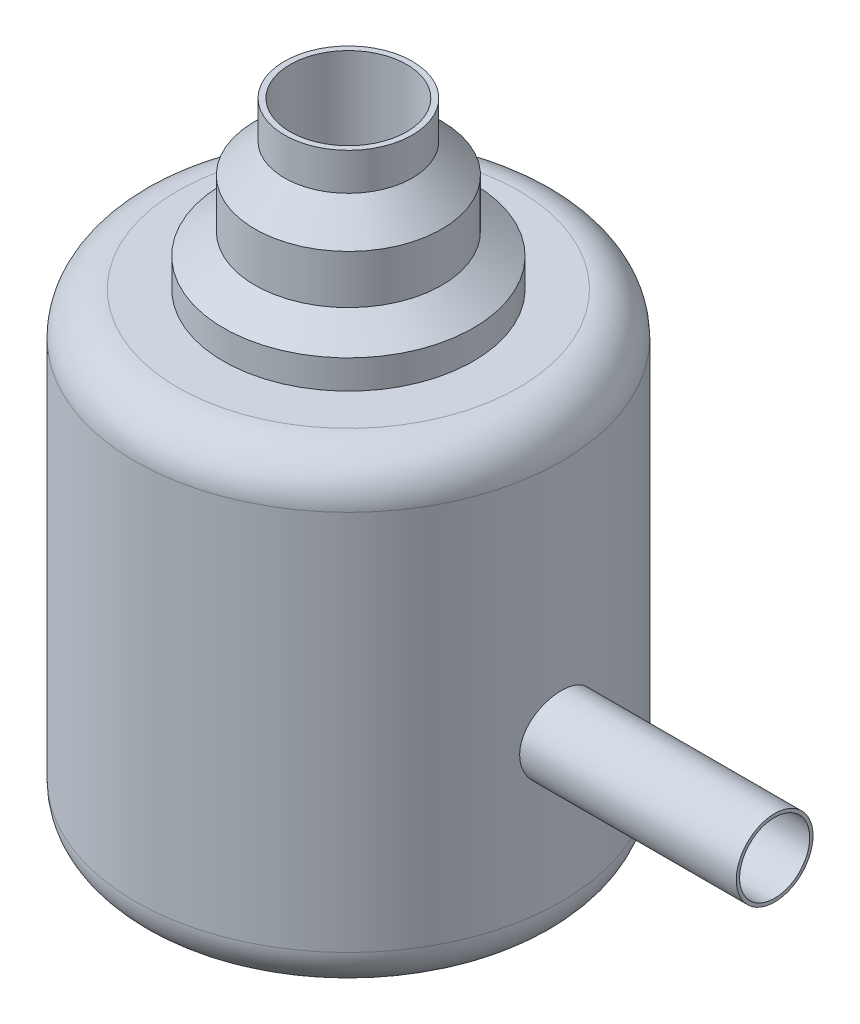
ISO-10303-21;
HEADER;
FILE_DESCRIPTION(('STEP AP214'),'2;1');
FILE_NAME('part.step','',(''),(''),'','','');
FILE_SCHEMA(('AUTOMOTIVE_DESIGN { 1 0 10303 214 1 1 1 1 }'));
ENDSEC;
DATA;
#1=APPLICATION_CONTEXT('core data for automotive mechanical design processes');
#2=APPLICATION_PROTOCOL_DEFINITION('international standard','automotive_design',2000,#1);
#3=PRODUCT_CONTEXT('',#1,'mechanical');
#4=PRODUCT('Part','Part','',(#3));
#5=PRODUCT_RELATED_PRODUCT_CATEGORY('part','',(#4));
#6=PRODUCT_DEFINITION_FORMATION('','',#4);
#7=PRODUCT_DEFINITION_CONTEXT('part definition',#1,'design');
#8=PRODUCT_DEFINITION('design','',#6,#7);
#9=PRODUCT_DEFINITION_SHAPE('','',#8);
#10=(LENGTH_UNIT() NAMED_UNIT(*) SI_UNIT(.MILLI.,.METRE.));
#11=(NAMED_UNIT(*) PLANE_ANGLE_UNIT() SI_UNIT($,.RADIAN.));
#12=(NAMED_UNIT(*) SI_UNIT($,.STERADIAN.) SOLID_ANGLE_UNIT());
#13=UNCERTAINTY_MEASURE_WITH_UNIT(LENGTH_MEASURE(1.E-05),#10,'distance_accuracy_value','');
#14=(GEOMETRIC_REPRESENTATION_CONTEXT(3) GLOBAL_UNCERTAINTY_ASSIGNED_CONTEXT((#13)) GLOBAL_UNIT_ASSIGNED_CONTEXT((#10,
#11,#12)) REPRESENTATION_CONTEXT('',''));
#15=CARTESIAN_POINT('',(0.,0.,0.));
#16=DIRECTION('',(0.,0.,1.));
#17=DIRECTION('',(1.,0.,0.));
#18=AXIS2_PLACEMENT_3D('',#15,#16,#17);
#19=CARTESIAN_POINT('',(0.,5.,0.));
#20=DIRECTION('',(0.,-1.,0.));
#21=DIRECTION('',(0.,0.,-1.));
#22=AXIS2_PLACEMENT_3D('',#19,#20,#21);
#23=CYLINDRICAL_SURFACE('',#22,2.5);
#24=CARTESIAN_POINT('',(0.,0.5,0.));
#25=DIRECTION('',(0.,1.,0.));
#26=DIRECTION('',(0.,0.,1.));
#27=AXIS2_PLACEMENT_3D('',#24,#25,#26);
#28=CIRCLE('',#27,2.5);
#29=CARTESIAN_POINT('',(0.,0.5,2.5));
#30=VERTEX_POINT('',#29);
#31=EDGE_CURVE('E97',#30,#30,#28,.T.);
#32=ORIENTED_EDGE('',*,*,#31,.T.);
#33=EDGE_LOOP('',(#32));
#34=FACE_BOUND('',#33,.T.);
#35=CARTESIAN_POINT('',(0.,4.97145984724777,0.));
#36=DIRECTION('',(0.,-1.,0.));
#37=DIRECTION('',(0.,0.,-1.));
#38=AXIS2_PLACEMENT_3D('',#35,#36,#37);
#39=CIRCLE('',#38,2.5);
#40=CARTESIAN_POINT('',(0.,4.97145984724777,-2.5));
#41=VERTEX_POINT('',#40);
#42=EDGE_CURVE('E100',#41,#41,#39,.T.);
#43=ORIENTED_EDGE('',*,*,#42,.T.);
#44=EDGE_LOOP('',(#43));
#45=FACE_BOUND('',#44,.T.);
#46=CARTESIAN_POINT('',(2.45916652547159,2.19465586332906,0.45));
#47=CARTESIAN_POINT('',(2.45916700009061,2.16959983407843,0.449999020788159));
#48=CARTESIAN_POINT('',(2.45955361857294,2.14453088130413,0.447900222638888));
#49=CARTESIAN_POINT('',(2.46105658666532,2.09509855430194,0.43956538979337));
#50=CARTESIAN_POINT('',(2.46217357539124,2.07073581757099,0.43332573153543));
#51=CARTESIAN_POINT('',(2.46500677092388,2.02343837328657,0.416905904971294));
#52=CARTESIAN_POINT('',(2.46672244087545,2.00050240794453,0.406729266186498));
#53=CARTESIAN_POINT('',(2.47055905098873,1.95666521118463,0.382733507034905));
#54=CARTESIAN_POINT('',(2.47267995433461,1.93576379518632,0.368914717517537));
#55=CARTESIAN_POINT('',(2.47711525388808,1.8963471986754,0.337857811883215));
#56=CARTESIAN_POINT('',(2.47943141528989,1.87785876164908,0.320586000807864));
#57=CARTESIAN_POINT('',(2.48398063455014,1.84402568339021,0.283186161317114));
#58=CARTESIAN_POINT('',(2.48621368714803,1.82868124088745,0.263057952486762));
#59=CARTESIAN_POINT('',(2.49036391293326,1.80147001055444,0.220341884816333));
#60=CARTESIAN_POINT('',(2.49227876542636,1.78962831944812,0.197737793963179));
#61=CARTESIAN_POINT('',(2.49555712244365,1.76992028191585,0.150820889649385));
#62=CARTESIAN_POINT('',(2.49692066874237,1.76205363427475,0.126508205819139));
#63=CARTESIAN_POINT('',(2.49893031295676,1.750601358274,0.0771411136896991));
#64=CARTESIAN_POINT('',(2.49958395261316,1.74697069724815,0.0520974642176861));
#65=CARTESIAN_POINT('',(2.50012609993544,1.74395324591702,0.00174852436273861));
#66=CARTESIAN_POINT('',(2.50001466785593,1.74456612140435,-0.0235567452590941));
#67=CARTESIAN_POINT('',(2.49904514916907,1.7499835916684,-0.0734021195457861));
#68=CARTESIAN_POINT('',(2.4981956983036,1.75473970707486,-0.0979476853601132));
#69=CARTESIAN_POINT('',(2.49585524820727,1.76823210000699,-0.14588656931623));
#70=CARTESIAN_POINT('',(2.49436422697923,1.77696851400365,-0.169279847919509));
#71=CARTESIAN_POINT('',(2.49089362923467,1.79822043892388,-0.214392052086347));
#72=CARTESIAN_POINT('',(2.48891152865838,1.81075555118634,-0.236101541541632));
#73=CARTESIAN_POINT('',(2.4846783558396,1.83923463588216,-0.277127122040465));
#74=CARTESIAN_POINT('',(2.48242725832428,1.85517892872631,-0.296442987850312));
#75=CARTESIAN_POINT('',(2.47786824428208,1.89029158077876,-0.332419962120039));
#76=CARTESIAN_POINT('',(2.47555997441616,1.90950233968338,-0.349039671120024));
#77=CARTESIAN_POINT('',(2.47117733103908,1.95046076011608,-0.378827096388199));
#78=CARTESIAN_POINT('',(2.46910296044174,1.97220845324134,-0.391994769655088));
#79=CARTESIAN_POINT('',(2.46542258637708,2.01767571911762,-0.414514765312475));
#80=CARTESIAN_POINT('',(2.4638172750181,2.04139814002303,-0.423861457781443));
#81=CARTESIAN_POINT('',(2.4612676698828,2.09011189304201,-0.43842520384135));
#82=CARTESIAN_POINT('',(2.46032330750784,2.11510309318254,-0.443642686002587));
#83=CARTESIAN_POINT('',(2.45921598987445,2.16527276155181,-0.449740266533624));
#84=CARTESIAN_POINT('',(2.45904235124834,2.19044379321729,-0.450679670168357));
#85=CARTESIAN_POINT('',(2.45946760229543,2.24058317429225,-0.448353053755119));
#86=CARTESIAN_POINT('',(2.46006645691192,2.26555153284755,-0.445087224545904));
#87=CARTESIAN_POINT('',(2.4619592973222,2.3143843032453,-0.434493631837015));
#88=CARTESIAN_POINT('',(2.46324801815449,2.33825560863319,-0.427196620425268));
#89=CARTESIAN_POINT('',(2.46637089326836,2.38443669808101,-0.408780286466631));
#90=CARTESIAN_POINT('',(2.46820508497229,2.40674637487469,-0.397660701661594));
#91=CARTESIAN_POINT('',(2.47223674833291,2.44943318438501,-0.37177707843621));
#92=CARTESIAN_POINT('',(2.47443789168986,2.46978712478758,-0.356975374196626));
#93=CARTESIAN_POINT('',(2.47894496626529,2.50774372543121,-0.324198805212407));
#94=CARTESIAN_POINT('',(2.48125090612368,2.5253461582924,-0.306223678482672));
#95=CARTESIAN_POINT('',(2.48574188391544,2.55751976946389,-0.267346423767884));
#96=CARTESIAN_POINT('',(2.48792509542031,2.57205118622935,-0.2464111465944));
#97=CARTESIAN_POINT('',(2.49189444607153,2.59739044345025,-0.202361997006681));
#98=CARTESIAN_POINT('',(2.49368059963721,2.60819841913188,-0.179248203749609));
#99=CARTESIAN_POINT('',(2.4966466975497,2.62572359073965,-0.131611066519807));
#100=CARTESIAN_POINT('',(2.4978296014407,2.63246078862532,-0.107095273334437));
#101=CARTESIAN_POINT('',(2.49946850276109,2.64171722293049,-0.0572569638817049));
#102=CARTESIAN_POINT('',(2.49992457042282,2.64423686688264,-0.0319345257995913));
#103=CARTESIAN_POINT('',(2.50005716694735,2.64497339657912,0.0184160473596289));
#104=CARTESIAN_POINT('',(2.499744605382,2.64325049855536,0.0434432929632689));
#105=CARTESIAN_POINT('',(2.49839758315684,2.63568212310757,0.0928456030303576));
#106=CARTESIAN_POINT('',(2.49736312828312,2.62983667872637,0.117220672719469));
#107=CARTESIAN_POINT('',(2.49468836827172,2.6142136896678,0.16459816177846));
#108=CARTESIAN_POINT('',(2.49304897750304,2.60444207747661,0.187602592249035));
#109=CARTESIAN_POINT('',(2.4893423651149,2.58125114741473,0.2316544998616));
#110=CARTESIAN_POINT('',(2.48727511788866,2.56783161120441,0.252701859765582));
#111=CARTESIAN_POINT('',(2.48290672924167,2.53751615980739,0.292543490433678));
#112=CARTESIAN_POINT('',(2.48060285013541,2.52057651210707,0.311304188805317));
#113=CARTESIAN_POINT('',(2.47603874783683,2.48379287882065,0.345737719781497));
#114=CARTESIAN_POINT('',(2.4737785350138,2.46394821275555,0.361409826882842));
#115=CARTESIAN_POINT('',(2.4695369702068,2.42171843437918,0.389344354011945));
#116=CARTESIAN_POINT('',(2.46755812621009,2.3993133402495,0.401576956414984));
#117=CARTESIAN_POINT('',(2.46413330431453,2.35273846508072,0.422085375613002));
#118=CARTESIAN_POINT('',(2.46268681271456,2.32857041236738,0.430365009188423));
#119=CARTESIAN_POINT('',(2.46079930219932,2.28604445432979,0.441006364175076));
#120=CARTESIAN_POINT('',(2.46019055933511,2.26793887413308,0.44437333754494));
#121=CARTESIAN_POINT('',(2.45937400145392,2.23144313497739,0.448870488586383));
#122=CARTESIAN_POINT('',(2.45916617698769,2.21305298273578,0.45000071897574));
#123=CARTESIAN_POINT('',(2.45916652547159,2.19465586332906,0.45));
#124=B_SPLINE_CURVE_WITH_KNOTS('',3,(#46,#47,#48,#49,#50,#51,#52,#53,#54,#55,#56,#57,#58,#59,
#60,#61,#62,#63,#64,#65,#66,#67,#68,#69,#70,#71,#72,#73,#74,#75,#76,#77,#78,#79,#80,#81,#82,#83,
#84,#85,#86,#87,#88,#89,#90,#91,#92,#93,#94,#95,#96,#97,#98,#99,#100,#101,#102,#103,#104,#105,
#106,#107,#108,#109,#110,#111,#112,#113,#114,#115,#116,#117,#118,#119,#120,#121,#122,#123),
.UNSPECIFIED.,.T.,.F.,(4,2,2,2,2,2,2,2,2,2,2,2,2,2,2,2,2,2,2,2,2,2,2,2,2,2,2,2,2,2,2,2,2,2,2,2,
2,2,4),(0.,0.0751007823268403,0.150267370254431,0.22536672656481,0.300459263272543,
0.376323862117609,0.452193254834605,0.528593759262509,0.604988473453798,0.680563415899286,
0.756132406371251,0.830828875898624,0.905527906708146,0.980619145462742,1.05571744474902,
1.13187761485452,1.20803873362657,1.28431166897139,1.36057668691782,1.43578118997335,
1.51098228027423,1.58561746219842,1.66025776569654,1.7356954769807,1.81113941901613,
1.88750727069083,1.96387234858118,2.03985908536669,2.11583847930254,2.1907456970715,
2.26565231445467,2.3404461701604,2.41524450349772,2.49103454895586,2.56684237616233,
2.64328844261479,2.71966054670552,2.77480378632885,2.82994572626614),.UNSPECIFIED.);
#125=CARTESIAN_POINT('',(2.45916652547159,2.19465586332906,0.45));
#126=VERTEX_POINT('',#125);
#127=EDGE_CURVE('E13',#126,#126,#124,.T.);
#128=ORIENTED_EDGE('',*,*,#127,.F.);
#129=EDGE_LOOP('',(#128));
#130=FACE_BOUND('',#129,.T.);
#131=ADVANCED_FACE('F48',(#34,#45,#130),#23,.T.);
#132=CARTESIAN_POINT('',(0.,2.41170500163225,0.));
#133=DIRECTION('',(0.,1.,0.));
#134=DIRECTION('',(0.,0.,1.));
#135=AXIS2_PLACEMENT_3D('',#132,#133,#134);
#136=CYLINDRICAL_SURFACE('',#135,0.684081366717814);
#137=CARTESIAN_POINT('',(0.,7.41170500163225,0.));
#138=DIRECTION('',(0.,1.,0.));
#139=DIRECTION('',(0.,0.,1.));
#140=AXIS2_PLACEMENT_3D('',#137,#138,#139);
#141=CIRCLE('',#140,0.684081366717814);
#142=CARTESIAN_POINT('',(0.,7.41170500163225,0.684081366717814));
#143=VERTEX_POINT('',#142);
#144=EDGE_CURVE('E121',#143,#143,#141,.T.);
#145=ORIENTED_EDGE('',*,*,#144,.T.);
#146=EDGE_LOOP('',(#145));
#147=FACE_BOUND('',#146,.T.);
#148=CARTESIAN_POINT('',(0.559086437618253,2.41170500163225,0.394194966433925));
#149=CARTESIAN_POINT('',(0.56819223479094,2.43505489974119,0.381309563478731));
#150=CARTESIAN_POINT('',(0.577944555971367,2.45707385288753,0.366506319229733));
#151=CARTESIAN_POINT('',(0.597740015819832,2.49824593037342,0.333232904689417));
#152=CARTESIAN_POINT('',(0.607784562028611,2.51738081872068,0.314740989167724));
#153=CARTESIAN_POINT('',(0.627035245591565,2.5523063066724,0.274401873820857));
#154=CARTESIAN_POINT('',(0.636240531191029,2.56809352984607,0.252551324443789));
#155=CARTESIAN_POINT('',(0.65282760549201,2.59570343765974,0.205894553807777));
#156=CARTESIAN_POINT('',(0.660213859502233,2.60753585649815,0.181095796405966));
#157=CARTESIAN_POINT('',(0.671807761588296,2.62582135707166,0.131302145757603));
#158=CARTESIAN_POINT('',(0.676226997863141,2.63263704561568,0.106491403274105));
#159=CARTESIAN_POINT('',(0.682283125938488,2.64193198227892,0.0557415003158792));
#160=CARTESIAN_POINT('',(0.683922771831197,2.64441552287653,0.0298034829488369));
#161=CARTESIAN_POINT('',(0.684195504829112,2.6448287372204,-0.0181007484025764));
#162=CARTESIAN_POINT('',(0.683253425931587,2.6434018818809,-0.0400623319784526));
#163=CARTESIAN_POINT('',(0.679330952566705,2.63740685730689,-0.0833600190429995));
#164=CARTESIAN_POINT('',(0.676350775121466,2.63283902253188,-0.104696188875139));
#165=CARTESIAN_POINT('',(0.668686372909232,2.62091222057526,-0.145792253349567));
#166=CARTESIAN_POINT('',(0.664034943245019,2.61360686099313,-0.165574114882565));
#167=CARTESIAN_POINT('',(0.653371400153962,2.59649120105742,-0.203627445321289));
#168=CARTESIAN_POINT('',(0.647358589755277,2.58667961728753,-0.22189813400315));
#169=CARTESIAN_POINT('',(0.633579117965742,2.5635088131384,-0.258802382749796));
#170=CARTESIAN_POINT('',(0.625688002002732,2.54986289942897,-0.277208565578021));
#171=CARTESIAN_POINT('',(0.609292642137944,2.52011609195786,-0.311597068852544));
#172=CARTESIAN_POINT('',(0.600788377168108,2.50401511381792,-0.327579305952426));
#173=CARTESIAN_POINT('',(0.586598522800745,2.47524775081241,-0.352135678063351));
#174=CARTESIAN_POINT('',(0.580902805015181,2.4631856693696,-0.361420823173144));
#175=CARTESIAN_POINT('',(0.569758352790097,2.43813371220926,-0.37874683777289));
#176=CARTESIAN_POINT('',(0.564309152095157,2.42514571889093,-0.386790132148439));
#177=CARTESIAN_POINT('',(0.559086437618253,2.41170500163225,-0.394194966433925));
#178=B_SPLINE_CURVE_WITH_KNOTS('',3,(#148,#149,#150,#151,#152,#153,#154,#155,#156,#157,#158,
#159,#160,#161,#162,#163,#164,#165,#166,#167,#168,#169,#170,#171,#172,#173,#174,#175,#176,#177),
.UNSPECIFIED.,.F.,.F.,(4,2,2,2,2,2,2,2,2,2,2,2,2,2,4),(0.,0.0844231429807033,0.169359519175955,
0.254381158351202,0.339191960475625,0.417022048415616,0.494774975060713,0.5605318853821,
0.626281794823936,0.690806263628637,0.755363841346448,0.827792817057505,0.900224282645873,
0.948912029608309,0.997503470739534),.UNSPECIFIED.);
#179=CARTESIAN_POINT('',(0.559086437618253,2.41170500163225,0.394194966433925));
#180=VERTEX_POINT('',#179);
#181=CARTESIAN_POINT('',(0.559086437618253,2.41170500163225,-0.394194966433925));
#182=VERTEX_POINT('',#181);
#183=EDGE_CURVE('E70',#180,#182,#178,.T.);
#184=ORIENTED_EDGE('',*,*,#183,.F.);
#185=CARTESIAN_POINT('',(0.,2.41170500163225,0.));
#186=DIRECTION('',(0.,1.,0.));
#187=DIRECTION('',(0.,0.,1.));
#188=AXIS2_PLACEMENT_3D('',#185,#186,#187);
#189=CIRCLE('',#188,0.684081366717814);
#190=EDGE_CURVE('E90',#182,#180,#189,.T.);
#191=ORIENTED_EDGE('',*,*,#190,.F.);
#192=EDGE_LOOP('',(#184,#191));
#193=FACE_BOUND('',#192,.T.);
#194=ADVANCED_FACE('F146',(#147,#193),#136,.F.);
#195=CARTESIAN_POINT('',(0.,2.41170500163225,0.));
#196=DIRECTION('',(0.,1.,0.));
#197=DIRECTION('',(0.,0.,1.));
#198=AXIS2_PLACEMENT_3D('',#195,#196,#197);
#199=PLANE('',#198);
#200=DIRECTION('',(0.,0.,-1.));
#201=VECTOR('',#200,1.);
#202=CARTESIAN_POINT('',(0.,2.41170500163225,0.));
#203=LINE('',#202,#201);
#204=CARTESIAN_POINT('',(0.,2.41170500163225,0.394194966433925));
#205=VERTEX_POINT('',#204);
#206=CARTESIAN_POINT('',(0.,2.41170500163225,-0.394194966433925));
#207=VERTEX_POINT('',#206);
#208=EDGE_CURVE('E76',#205,#207,#203,.T.);
#209=ORIENTED_EDGE('',*,*,#208,.T.);
#210=DIRECTION('',(-1.,0.,0.));
#211=VECTOR('',#210,1.);
#212=CARTESIAN_POINT('',(5.,2.41170500163225,-0.394194966433925));
#213=LINE('',#212,#211);
#214=EDGE_CURVE('E52',#207,#182,#213,.F.);
#215=ORIENTED_EDGE('',*,*,#214,.T.);
#216=ORIENTED_EDGE('',*,*,#190,.T.);
#217=DIRECTION('',(-1.,0.,0.));
#218=VECTOR('',#217,1.);
#219=CARTESIAN_POINT('',(5.,2.41170500163225,0.394194966433925));
#220=LINE('',#219,#218);
#221=EDGE_CURVE('E80',#180,#205,#220,.T.);
#222=ORIENTED_EDGE('',*,*,#221,.T.);
#223=EDGE_LOOP('',(#209,#215,#216,#222));
#224=FACE_BOUND('',#223,.T.);
#225=ADVANCED_FACE('F88',(#224),#199,.T.);
#226=CARTESIAN_POINT('',(0.,0.,0.));
#227=DIRECTION('',(0.,1.,0.));
#228=DIRECTION('',(0.,0.,1.));
#229=AXIS2_PLACEMENT_3D('',#226,#227,#228);
#230=PLANE('',#229);
#231=CARTESIAN_POINT('',(0.,0.,0.));
#232=DIRECTION('',(0.,1.,0.));
#233=DIRECTION('',(0.,0.,1.));
#234=AXIS2_PLACEMENT_3D('',#231,#232,#233);
#235=CIRCLE('',#234,2.);
#236=CARTESIAN_POINT('',(0.,0.,2.));
#237=VERTEX_POINT('',#236);
#238=EDGE_CURVE('E94',#237,#237,#235,.F.);
#239=ORIENTED_EDGE('',*,*,#238,.T.);
#240=EDGE_LOOP('',(#239));
#241=FACE_BOUND('',#240,.T.);
#242=ADVANCED_FACE('F145',(#241),#230,.F.);
#243=CARTESIAN_POINT('',(0.,7.41170500163225,0.));
#244=DIRECTION('',(0.,-1.,0.));
#245=DIRECTION('',(0.,0.,-1.));
#246=AXIS2_PLACEMENT_3D('',#243,#244,#245);
#247=PLANE('',#246);
#248=ORIENTED_EDGE('',*,*,#144,.F.);
#249=EDGE_LOOP('',(#248));
#250=FACE_BOUND('',#249,.T.);
#251=CARTESIAN_POINT('',(0.,7.41170500163225,0.));
#252=DIRECTION('',(0.,-1.,0.));
#253=DIRECTION('',(0.,0.,-1.));
#254=AXIS2_PLACEMENT_3D('',#251,#252,#253);
#255=CIRCLE('',#254,0.75);
#256=CARTESIAN_POINT('',(0.,7.41170500163225,-0.75));
#257=VERTEX_POINT('',#256);
#258=EDGE_CURVE('E103',#257,#257,#255,.T.);
#259=ORIENTED_EDGE('',*,*,#258,.F.);
#260=EDGE_LOOP('',(#259));
#261=FACE_BOUND('',#260,.T.);
#262=ADVANCED_FACE('F175',(#250,#261),#247,.F.);
#263=CARTESIAN_POINT('',(0.,0.,0.));
#264=DIRECTION('',(0.,-1.,0.));
#265=DIRECTION('',(0.,0.,-1.));
#266=AXIS2_PLACEMENT_3D('',#263,#264,#265);
#267=CYLINDRICAL_SURFACE('',#266,0.75);
#268=CARTESIAN_POINT('',(0.,6.97506156400285,0.));
#269=DIRECTION('',(0.,-1.,0.));
#270=DIRECTION('',(0.,0.,-1.));
#271=AXIS2_PLACEMENT_3D('',#268,#269,#270);
#272=CIRCLE('',#271,0.75);
#273=CARTESIAN_POINT('',(0.,6.97506156400285,-0.75));
#274=VERTEX_POINT('',#273);
#275=EDGE_CURVE('E106',#274,#274,#272,.T.);
#276=ORIENTED_EDGE('',*,*,#275,.F.);
#277=EDGE_LOOP('',(#276));
#278=FACE_BOUND('',#277,.T.);
#279=ORIENTED_EDGE('',*,*,#258,.T.);
#280=EDGE_LOOP('',(#279));
#281=FACE_BOUND('',#280,.T.);
#282=ADVANCED_FACE('F171',(#278,#281),#267,.T.);
#283=CARTESIAN_POINT('',(0.,6.97506156400285,0.));
#284=DIRECTION('',(0.,-1.,0.));
#285=DIRECTION('',(0.,0.,-1.));
#286=AXIS2_PLACEMENT_3D('',#283,#284,#285);
#287=CONICAL_SURFACE('',#286,0.75,0.785398163397423);
#288=CARTESIAN_POINT('',(0.,6.6291689962043,0.));
#289=DIRECTION('',(0.,-1.,0.));
#290=DIRECTION('',(0.,0.,-1.));
#291=AXIS2_PLACEMENT_3D('',#288,#289,#290);
#292=CIRCLE('',#291,1.09589256779853);
#293=CARTESIAN_POINT('',(0.,6.6291689962043,-1.09589256779853));
#294=VERTEX_POINT('',#293);
#295=EDGE_CURVE('E109',#294,#294,#292,.T.);
#296=ORIENTED_EDGE('',*,*,#295,.F.);
#297=EDGE_LOOP('',(#296));
#298=FACE_BOUND('',#297,.T.);
#299=ORIENTED_EDGE('',*,*,#275,.T.);
#300=EDGE_LOOP('',(#299));
#301=FACE_BOUND('',#300,.T.);
#302=ADVANCED_FACE('F167',(#298,#301),#287,.T.);
#303=CARTESIAN_POINT('',(0.,0.,0.));
#304=DIRECTION('',(0.,-1.,0.));
#305=DIRECTION('',(0.,0.,-1.));
#306=AXIS2_PLACEMENT_3D('',#303,#304,#305);
#307=CYLINDRICAL_SURFACE('',#306,1.09589256779853);
#308=CARTESIAN_POINT('',(0.,6.05842736234468,0.));
#309=DIRECTION('',(0.,-1.,0.));
#310=DIRECTION('',(0.,0.,-1.));
#311=AXIS2_PLACEMENT_3D('',#308,#309,#310);
#312=CIRCLE('',#311,1.09589256779853);
#313=CARTESIAN_POINT('',(0.,6.05842736234468,-1.09589256779853));
#314=VERTEX_POINT('',#313);
#315=EDGE_CURVE('E112',#314,#314,#312,.T.);
#316=ORIENTED_EDGE('',*,*,#315,.F.);
#317=EDGE_LOOP('',(#316));
#318=FACE_BOUND('',#317,.T.);
#319=ORIENTED_EDGE('',*,*,#295,.T.);
#320=EDGE_LOOP('',(#319));
#321=FACE_BOUND('',#320,.T.);
#322=ADVANCED_FACE('F163',(#318,#321),#307,.T.);
#323=CARTESIAN_POINT('',(0.,6.05842736234468,0.));
#324=DIRECTION('',(0.,-1.,0.));
#325=DIRECTION('',(0.,0.,-1.));
#326=AXIS2_PLACEMENT_3D('',#323,#324,#325);
#327=CONICAL_SURFACE('',#326,1.09589256779853,0.977974870913565);
#328=CARTESIAN_POINT('',(0.,5.80916718470078,0.));
#329=DIRECTION('',(0.,-1.,0.));
#330=DIRECTION('',(0.,0.,-1.));
#331=AXIS2_PLACEMENT_3D('',#328,#329,#330);
#332=CIRCLE('',#331,1.4659070882723);
#333=CARTESIAN_POINT('',(0.,5.80916718470078,-1.4659070882723));
#334=VERTEX_POINT('',#333);
#335=EDGE_CURVE('E115',#334,#334,#332,.T.);
#336=ORIENTED_EDGE('',*,*,#335,.F.);
#337=EDGE_LOOP('',(#336));
#338=FACE_BOUND('',#337,.T.);
#339=ORIENTED_EDGE('',*,*,#315,.T.);
#340=EDGE_LOOP('',(#339));
#341=FACE_BOUND('',#340,.T.);
#342=ADVANCED_FACE('F159',(#338,#341),#327,.T.);
#343=CARTESIAN_POINT('',(0.,0.,0.));
#344=DIRECTION('',(0.,-1.,0.));
#345=DIRECTION('',(0.,0.,-1.));
#346=AXIS2_PLACEMENT_3D('',#343,#344,#345);
#347=CYLINDRICAL_SURFACE('',#346,1.4659070882723);
#348=CARTESIAN_POINT('',(0.,5.47145984724777,0.));
#349=DIRECTION('',(0.,-1.,0.));
#350=DIRECTION('',(0.,0.,-1.));
#351=AXIS2_PLACEMENT_3D('',#348,#349,#350);
#352=CIRCLE('',#351,1.4659070882723);
#353=CARTESIAN_POINT('',(0.,5.47145984724777,-1.4659070882723));
#354=VERTEX_POINT('',#353);
#355=EDGE_CURVE('E118',#354,#354,#352,.T.);
#356=ORIENTED_EDGE('',*,*,#355,.F.);
#357=EDGE_LOOP('',(#356));
#358=FACE_BOUND('',#357,.T.);
#359=ORIENTED_EDGE('',*,*,#335,.T.);
#360=EDGE_LOOP('',(#359));
#361=FACE_BOUND('',#360,.T.);
#362=ADVANCED_FACE('F155',(#358,#361),#347,.T.);
#363=CARTESIAN_POINT('',(-1.4659070882723,5.47145984724777,0.));
#364=DIRECTION('',(0.,-1.,0.));
#365=DIRECTION('',(0.,0.,-1.));
#366=AXIS2_PLACEMENT_3D('',#363,#364,#365);
#367=PLANE('',#366);
#368=CARTESIAN_POINT('',(0.,5.47145984724777,0.));
#369=DIRECTION('',(0.,-1.,0.));
#370=DIRECTION('',(0.,0.,-1.));
#371=AXIS2_PLACEMENT_3D('',#368,#369,#370);
#372=CIRCLE('',#371,2.);
#373=CARTESIAN_POINT('',(0.,5.47145984724777,-2.));
#374=VERTEX_POINT('',#373);
#375=EDGE_CURVE('E81',#374,#374,#372,.F.);
#376=ORIENTED_EDGE('',*,*,#375,.T.);
#377=EDGE_LOOP('',(#376));
#378=FACE_BOUND('',#377,.T.);
#379=ORIENTED_EDGE('',*,*,#355,.T.);
#380=EDGE_LOOP('',(#379));
#381=FACE_BOUND('',#380,.T.);
#382=ADVANCED_FACE('F151',(#378,#381),#367,.F.);
#383=CARTESIAN_POINT('',(0.,0.5,0.));
#384=DIRECTION('',(0.,1.,0.));
#385=DIRECTION('',(0.,0.,1.));
#386=AXIS2_PLACEMENT_3D('',#383,#384,#385);
#387=TOROIDAL_SURFACE('',#386,2.,0.5);
#388=ORIENTED_EDGE('',*,*,#238,.F.);
#389=EDGE_LOOP('',(#388));
#390=FACE_BOUND('',#389,.T.);
#391=ORIENTED_EDGE('',*,*,#31,.F.);
#392=EDGE_LOOP('',(#391));
#393=FACE_BOUND('',#392,.T.);
#394=ADVANCED_FACE('F154',(#390,#393),#387,.T.);
#395=CARTESIAN_POINT('',(0.,4.97145984724777,0.));
#396=DIRECTION('',(0.,-1.,0.));
#397=DIRECTION('',(0.,0.,-1.));
#398=AXIS2_PLACEMENT_3D('',#395,#396,#397);
#399=TOROIDAL_SURFACE('',#398,2.,0.5);
#400=ORIENTED_EDGE('',*,*,#375,.F.);
#401=EDGE_LOOP('',(#400));
#402=FACE_BOUND('',#401,.T.);
#403=ORIENTED_EDGE('',*,*,#42,.F.);
#404=EDGE_LOOP('',(#403));
#405=FACE_BOUND('',#404,.T.);
#406=ADVANCED_FACE('F50',(#402,#405),#399,.T.);
#407=CARTESIAN_POINT('',(0.,2.19465586332906,0.));
#408=DIRECTION('',(1.,0.,0.));
#409=DIRECTION('',(0.,0.,-1.));
#410=AXIS2_PLACEMENT_3D('',#407,#408,#409);
#411=PLANE('',#410);
#412=ORIENTED_EDGE('',*,*,#208,.F.);
#413=CARTESIAN_POINT('',(0.,2.19465586332906,0.));
#414=DIRECTION('',(1.,0.,0.));
#415=DIRECTION('',(0.,0.,-1.));
#416=AXIS2_PLACEMENT_3D('',#413,#414,#415);
#417=CIRCLE('',#416,0.45);
#418=EDGE_CURVE('E63',#207,#205,#417,.T.);
#419=ORIENTED_EDGE('',*,*,#418,.F.);
#420=EDGE_LOOP('',(#412,#419));
#421=FACE_BOUND('',#420,.T.);
#422=ADVANCED_FACE('F77',(#421),#411,.F.);
#423=CARTESIAN_POINT('',(5.,2.19465586332906,0.));
#424=DIRECTION('',(-1.,0.,0.));
#425=DIRECTION('',(0.,0.,1.));
#426=AXIS2_PLACEMENT_3D('',#423,#424,#425);
#427=CYLINDRICAL_SURFACE('',#426,0.45);
#428=ORIENTED_EDGE('',*,*,#214,.F.);
#429=ORIENTED_EDGE('',*,*,#418,.T.);
#430=ORIENTED_EDGE('',*,*,#221,.F.);
#431=ORIENTED_EDGE('',*,*,#183,.T.);
#432=EDGE_LOOP('',(#428,#429,#430,#431));
#433=FACE_BOUND('',#432,.T.);
#434=ADVANCED_FACE('F83',(#433),#427,.T.);
#435=CARTESIAN_POINT('',(5.,2.19465586332906,0.));
#436=DIRECTION('',(1.,0.,0.));
#437=DIRECTION('',(0.,0.,-1.));
#438=AXIS2_PLACEMENT_3D('',#435,#436,#437);
#439=CIRCLE('',#438,0.45);
#440=CARTESIAN_POINT('',(5.,2.19465586332906,-0.45));
#441=VERTEX_POINT('',#440);
#442=EDGE_CURVE('E84',#441,#441,#439,.T.);
#443=ORIENTED_EDGE('',*,*,#442,.F.);
#444=EDGE_LOOP('',(#443));
#445=FACE_BOUND('',#444,.T.);
#446=ORIENTED_EDGE('',*,*,#127,.T.);
#447=EDGE_LOOP('',(#446));
#448=FACE_BOUND('',#447,.T.);
#449=ADVANCED_FACE('F141',(#445,#448),#427,.T.);
#450=CARTESIAN_POINT('',(5.,2.19465586332906,0.));
#451=DIRECTION('',(1.,0.,0.));
#452=DIRECTION('',(0.,0.,-1.));
#453=AXIS2_PLACEMENT_3D('',#450,#451,#452);
#454=PLANE('',#453);
#455=CARTESIAN_POINT('',(5.,2.19465586332906,0.));
#456=DIRECTION('',(1.,0.,0.));
#457=DIRECTION('',(0.,0.,-1.));
#458=AXIS2_PLACEMENT_3D('',#455,#456,#457);
#459=CIRCLE('',#458,0.411041125617825);
#460=CARTESIAN_POINT('',(5.,2.19465586332906,-0.411041125617825));
#461=VERTEX_POINT('',#460);
#462=EDGE_CURVE('E206',#461,#461,#459,.T.);
#463=ORIENTED_EDGE('',*,*,#462,.F.);
#464=EDGE_LOOP('',(#463));
#465=FACE_BOUND('',#464,.T.);
#466=ORIENTED_EDGE('',*,*,#442,.T.);
#467=EDGE_LOOP('',(#466));
#468=FACE_BOUND('',#467,.T.);
#469=ADVANCED_FACE('F194',(#465,#468),#454,.T.);
#470=CARTESIAN_POINT('',(1.,2.19465586332906,0.));
#471=DIRECTION('',(1.,0.,0.));
#472=DIRECTION('',(0.,0.,-1.));
#473=AXIS2_PLACEMENT_3D('',#470,#471,#472);
#474=CYLINDRICAL_SURFACE('',#473,0.411041125617825);
#475=CARTESIAN_POINT('',(1.,2.19465586332906,0.));
#476=DIRECTION('',(1.,0.,0.));
#477=DIRECTION('',(0.,0.,-1.));
#478=AXIS2_PLACEMENT_3D('',#475,#476,#477);
#479=CIRCLE('',#478,0.411041125617825);
#480=CARTESIAN_POINT('',(1.,2.19465586332906,-0.411041125617825));
#481=VERTEX_POINT('',#480);
#482=EDGE_CURVE('E85',#481,#481,#479,.T.);
#483=ORIENTED_EDGE('',*,*,#482,.F.);
#484=EDGE_LOOP('',(#483));
#485=FACE_BOUND('',#484,.T.);
#486=ORIENTED_EDGE('',*,*,#462,.T.);
#487=EDGE_LOOP('',(#486));
#488=FACE_BOUND('',#487,.T.);
#489=ADVANCED_FACE('F199',(#485,#488),#474,.F.);
#490=CARTESIAN_POINT('',(1.,2.19465586332906,0.));
#491=DIRECTION('',(1.,0.,0.));
#492=DIRECTION('',(0.,0.,-1.));
#493=AXIS2_PLACEMENT_3D('',#490,#491,#492);
#494=PLANE('',#493);
#495=ORIENTED_EDGE('',*,*,#482,.T.);
#496=EDGE_LOOP('',(#495));
#497=FACE_BOUND('',#496,.T.);
#498=ADVANCED_FACE('F212',(#497),#494,.T.);
#499=CLOSED_SHELL('',(#131,#194,#225,#242,#262,#282,#302,#322,#342,#362,#382,#394,#406,#422,
#434,#449,#469,#489,#498));
#500=MANIFOLD_SOLID_BREP('B2',#499);
#501=ADVANCED_BREP_SHAPE_REPRESENTATION('',(#18,#500),#14);
#502=SHAPE_DEFINITION_REPRESENTATION(#9,#501);
ENDSEC;
END-ISO-10303-21;
